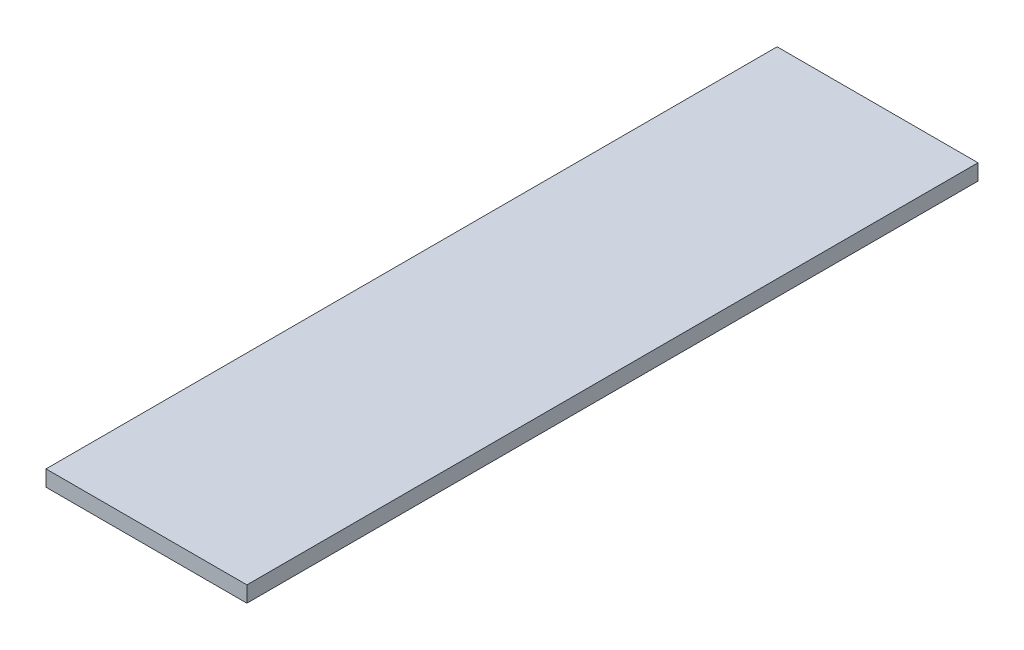
ISO-10303-21;
HEADER;
FILE_DESCRIPTION(('STEP AP214'),'2;1');
FILE_NAME('part.step','',(''),(''),'','','');
FILE_SCHEMA(('AUTOMOTIVE_DESIGN { 1 0 10303 214 1 1 1 1 }'));
ENDSEC;
DATA;
#1=APPLICATION_CONTEXT('core data for automotive mechanical design processes');
#2=APPLICATION_PROTOCOL_DEFINITION('international standard','automotive_design',2000,#1);
#3=PRODUCT_CONTEXT('',#1,'mechanical');
#4=PRODUCT('Part','Part','',(#3));
#5=PRODUCT_RELATED_PRODUCT_CATEGORY('part','',(#4));
#6=PRODUCT_DEFINITION_FORMATION('','',#4);
#7=PRODUCT_DEFINITION_CONTEXT('part definition',#1,'design');
#8=PRODUCT_DEFINITION('design','',#6,#7);
#9=PRODUCT_DEFINITION_SHAPE('','',#8);
#10=(LENGTH_UNIT() NAMED_UNIT(*) SI_UNIT(.MILLI.,.METRE.));
#11=(NAMED_UNIT(*) PLANE_ANGLE_UNIT() SI_UNIT($,.RADIAN.));
#12=(NAMED_UNIT(*) SI_UNIT($,.STERADIAN.) SOLID_ANGLE_UNIT());
#13=UNCERTAINTY_MEASURE_WITH_UNIT(LENGTH_MEASURE(1.E-05),#10,'distance_accuracy_value','');
#14=(GEOMETRIC_REPRESENTATION_CONTEXT(3) GLOBAL_UNCERTAINTY_ASSIGNED_CONTEXT((#13)) GLOBAL_UNIT_ASSIGNED_CONTEXT((#10,
#11,#12)) REPRESENTATION_CONTEXT('',''));
#15=CARTESIAN_POINT('',(0.,0.,0.));
#16=DIRECTION('',(0.,0.,1.));
#17=DIRECTION('',(1.,0.,0.));
#18=AXIS2_PLACEMENT_3D('',#15,#16,#17);
#19=CARTESIAN_POINT('',(0.,0.,146.05));
#20=DIRECTION('',(1.,0.,0.));
#21=DIRECTION('',(0.,0.,-1.));
#22=AXIS2_PLACEMENT_3D('',#19,#20,#21);
#23=PLANE('',#22);
#24=DIRECTION('',(0.,-1.,0.));
#25=VECTOR('',#24,1.);
#26=CARTESIAN_POINT('',(0.,0.,0.));
#27=LINE('',#26,#25);
#28=CARTESIAN_POINT('',(0.,3.175,0.));
#29=VERTEX_POINT('',#28);
#30=CARTESIAN_POINT('',(0.,0.,0.));
#31=VERTEX_POINT('',#30);
#32=EDGE_CURVE('E96',#29,#31,#27,.T.);
#33=ORIENTED_EDGE('',*,*,#32,.T.);
#34=DIRECTION('',(0.,0.,-1.));
#35=VECTOR('',#34,1.);
#36=CARTESIAN_POINT('',(0.,0.,146.05));
#37=LINE('',#36,#35);
#38=CARTESIAN_POINT('',(0.,0.,146.05));
#39=VERTEX_POINT('',#38);
#40=EDGE_CURVE('E11',#39,#31,#37,.T.);
#41=ORIENTED_EDGE('',*,*,#40,.F.);
#42=DIRECTION('',(0.,-1.,0.));
#43=VECTOR('',#42,1.);
#44=CARTESIAN_POINT('',(0.,0.,146.05));
#45=LINE('',#44,#43);
#46=CARTESIAN_POINT('',(0.,3.175,146.05));
#47=VERTEX_POINT('',#46);
#48=EDGE_CURVE('E84',#47,#39,#45,.T.);
#49=ORIENTED_EDGE('',*,*,#48,.F.);
#50=DIRECTION('',(0.,0.,-1.));
#51=VECTOR('',#50,1.);
#52=CARTESIAN_POINT('',(0.,3.175,146.05));
#53=LINE('',#52,#51);
#54=EDGE_CURVE('E92',#47,#29,#53,.T.);
#55=ORIENTED_EDGE('',*,*,#54,.T.);
#56=EDGE_LOOP('',(#33,#41,#49,#55));
#57=FACE_BOUND('',#56,.T.);
#58=ADVANCED_FACE('F33',(#57),#23,.F.);
#59=CARTESIAN_POINT('',(0.,0.,146.05));
#60=DIRECTION('',(0.,1.,0.));
#61=DIRECTION('',(0.,0.,1.));
#62=AXIS2_PLACEMENT_3D('',#59,#60,#61);
#63=PLANE('',#62);
#64=DIRECTION('',(1.,0.,0.));
#65=VECTOR('',#64,1.);
#66=CARTESIAN_POINT('',(0.,0.,0.));
#67=LINE('',#66,#65);
#68=CARTESIAN_POINT('',(40.132,0.,0.));
#69=VERTEX_POINT('',#68);
#70=EDGE_CURVE('E88',#31,#69,#67,.T.);
#71=ORIENTED_EDGE('',*,*,#70,.T.);
#72=DIRECTION('',(0.,0.,-1.));
#73=VECTOR('',#72,1.);
#74=CARTESIAN_POINT('',(40.132,0.,146.05));
#75=LINE('',#74,#73);
#76=CARTESIAN_POINT('',(40.132,0.,146.05));
#77=VERTEX_POINT('',#76);
#78=EDGE_CURVE('E41',#77,#69,#75,.T.);
#79=ORIENTED_EDGE('',*,*,#78,.F.);
#80=DIRECTION('',(1.,0.,0.));
#81=VECTOR('',#80,1.);
#82=CARTESIAN_POINT('',(0.,0.,146.05));
#83=LINE('',#82,#81);
#84=EDGE_CURVE('E79',#39,#77,#83,.T.);
#85=ORIENTED_EDGE('',*,*,#84,.F.);
#86=ORIENTED_EDGE('',*,*,#40,.T.);
#87=EDGE_LOOP('',(#71,#79,#85,#86));
#88=FACE_BOUND('',#87,.T.);
#89=ADVANCED_FACE('F87',(#88),#63,.F.);
#90=CARTESIAN_POINT('',(40.132,0.,146.05));
#91=DIRECTION('',(-1.,0.,0.));
#92=DIRECTION('',(0.,0.,1.));
#93=AXIS2_PLACEMENT_3D('',#90,#91,#92);
#94=PLANE('',#93);
#95=DIRECTION('',(0.,1.,0.));
#96=VECTOR('',#95,1.);
#97=CARTESIAN_POINT('',(40.132,0.,0.));
#98=LINE('',#97,#96);
#99=CARTESIAN_POINT('',(40.132,3.175,0.));
#100=VERTEX_POINT('',#99);
#101=EDGE_CURVE('E66',#69,#100,#98,.T.);
#102=ORIENTED_EDGE('',*,*,#101,.T.);
#103=DIRECTION('',(0.,0.,-1.));
#104=VECTOR('',#103,1.);
#105=CARTESIAN_POINT('',(40.132,3.175,146.05));
#106=LINE('',#105,#104);
#107=CARTESIAN_POINT('',(40.132,3.175,146.05));
#108=VERTEX_POINT('',#107);
#109=EDGE_CURVE('E89',#108,#100,#106,.T.);
#110=ORIENTED_EDGE('',*,*,#109,.F.);
#111=DIRECTION('',(0.,1.,0.));
#112=VECTOR('',#111,1.);
#113=CARTESIAN_POINT('',(40.132,0.,146.05));
#114=LINE('',#113,#112);
#115=EDGE_CURVE('E82',#77,#108,#114,.T.);
#116=ORIENTED_EDGE('',*,*,#115,.F.);
#117=ORIENTED_EDGE('',*,*,#78,.T.);
#118=EDGE_LOOP('',(#102,#110,#116,#117));
#119=FACE_BOUND('',#118,.T.);
#120=ADVANCED_FACE('F90',(#119),#94,.F.);
#121=CARTESIAN_POINT('',(0.,3.175,146.05));
#122=DIRECTION('',(0.,-1.,0.));
#123=DIRECTION('',(1.,0.,0.));
#124=AXIS2_PLACEMENT_3D('',#121,#122,#123);
#125=PLANE('',#124);
#126=DIRECTION('',(-1.,0.,0.));
#127=VECTOR('',#126,1.);
#128=CARTESIAN_POINT('',(0.,3.175,0.));
#129=LINE('',#128,#127);
#130=EDGE_CURVE('E72',#100,#29,#129,.T.);
#131=ORIENTED_EDGE('',*,*,#130,.T.);
#132=ORIENTED_EDGE('',*,*,#54,.F.);
#133=DIRECTION('',(-1.,0.,0.));
#134=VECTOR('',#133,1.);
#135=CARTESIAN_POINT('',(0.,3.175,146.05));
#136=LINE('',#135,#134);
#137=EDGE_CURVE('E49',#108,#47,#136,.T.);
#138=ORIENTED_EDGE('',*,*,#137,.F.);
#139=ORIENTED_EDGE('',*,*,#109,.T.);
#140=EDGE_LOOP('',(#131,#132,#138,#139));
#141=FACE_BOUND('',#140,.T.);
#142=ADVANCED_FACE('F103',(#141),#125,.F.);
#143=CARTESIAN_POINT('',(0.,0.,146.05));
#144=DIRECTION('',(0.,0.,-1.));
#145=DIRECTION('',(-1.,0.,0.));
#146=AXIS2_PLACEMENT_3D('',#143,#144,#145);
#147=PLANE('',#146);
#148=ORIENTED_EDGE('',*,*,#48,.T.);
#149=ORIENTED_EDGE('',*,*,#84,.T.);
#150=ORIENTED_EDGE('',*,*,#115,.T.);
#151=ORIENTED_EDGE('',*,*,#137,.T.);
#152=EDGE_LOOP('',(#148,#149,#150,#151));
#153=FACE_BOUND('',#152,.T.);
#154=ADVANCED_FACE('F80',(#153),#147,.F.);
#155=CARTESIAN_POINT('',(0.,0.,0.));
#156=DIRECTION('',(0.,0.,-1.));
#157=DIRECTION('',(-1.,0.,0.));
#158=AXIS2_PLACEMENT_3D('',#155,#156,#157);
#159=PLANE('',#158);
#160=ORIENTED_EDGE('',*,*,#32,.F.);
#161=ORIENTED_EDGE('',*,*,#130,.F.);
#162=ORIENTED_EDGE('',*,*,#101,.F.);
#163=ORIENTED_EDGE('',*,*,#70,.F.);
#164=EDGE_LOOP('',(#160,#161,#162,#163));
#165=FACE_BOUND('',#164,.T.);
#166=ADVANCED_FACE('F106',(#165),#159,.T.);
#167=CLOSED_SHELL('',(#58,#89,#120,#142,#154,#166));
#168=MANIFOLD_SOLID_BREP('B2',#167);
#169=ADVANCED_BREP_SHAPE_REPRESENTATION('',(#18,#168),#14);
#170=SHAPE_DEFINITION_REPRESENTATION(#9,#169);
ENDSEC;
END-ISO-10303-21;
